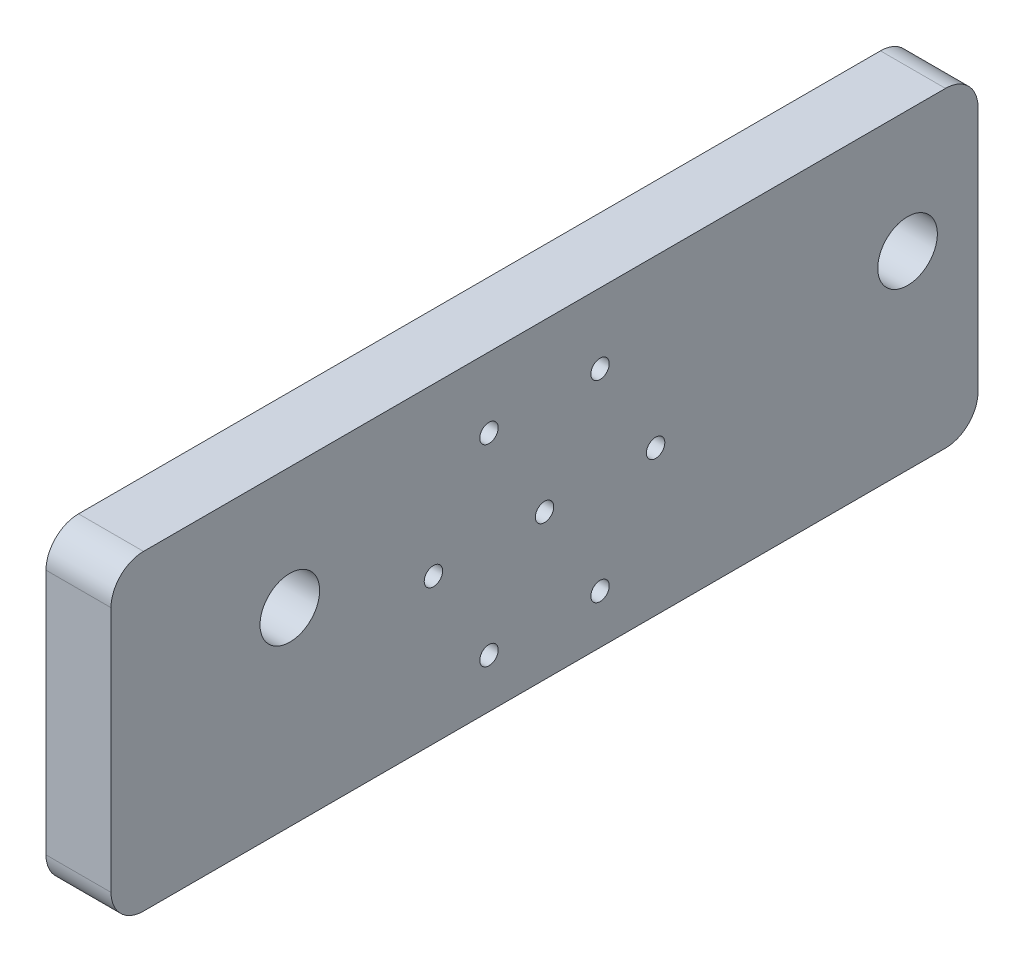
ISO-10303-21;
HEADER;
FILE_DESCRIPTION(('STEP AP214'),'2;1');
FILE_NAME('part.step','',(''),(''),'','','');
FILE_SCHEMA(('AUTOMOTIVE_DESIGN { 1 0 10303 214 1 1 1 1 }'));
ENDSEC;
DATA;
#1=APPLICATION_CONTEXT('core data for automotive mechanical design processes');
#2=APPLICATION_PROTOCOL_DEFINITION('international standard','automotive_design',2000,#1);
#3=PRODUCT_CONTEXT('',#1,'mechanical');
#4=PRODUCT('Part','Part','',(#3));
#5=PRODUCT_RELATED_PRODUCT_CATEGORY('part','',(#4));
#6=PRODUCT_DEFINITION_FORMATION('','',#4);
#7=PRODUCT_DEFINITION_CONTEXT('part definition',#1,'design');
#8=PRODUCT_DEFINITION('design','',#6,#7);
#9=PRODUCT_DEFINITION_SHAPE('','',#8);
#10=(LENGTH_UNIT() NAMED_UNIT(*) SI_UNIT(.MILLI.,.METRE.));
#11=(NAMED_UNIT(*) PLANE_ANGLE_UNIT() SI_UNIT($,.RADIAN.));
#12=(NAMED_UNIT(*) SI_UNIT($,.STERADIAN.) SOLID_ANGLE_UNIT());
#13=UNCERTAINTY_MEASURE_WITH_UNIT(LENGTH_MEASURE(1.E-05),#10,'distance_accuracy_value','');
#14=(GEOMETRIC_REPRESENTATION_CONTEXT(3) GLOBAL_UNCERTAINTY_ASSIGNED_CONTEXT((#13)) GLOBAL_UNIT_ASSIGNED_CONTEXT((#10,
#11,#12)) REPRESENTATION_CONTEXT('',''));
#15=CARTESIAN_POINT('',(0.,0.,0.));
#16=DIRECTION('',(0.,0.,1.));
#17=DIRECTION('',(1.,0.,0.));
#18=AXIS2_PLACEMENT_3D('',#15,#16,#17);
#19=CARTESIAN_POINT('',(0.,0.,0.));
#20=DIRECTION('',(1.,0.,0.));
#21=DIRECTION('',(0.,0.,-1.));
#22=AXIS2_PLACEMENT_3D('',#19,#20,#21);
#23=PLANE('',#22);
#24=DIRECTION('',(0.,1.,0.));
#25=VECTOR('',#24,1.);
#26=CARTESIAN_POINT('',(0.,14.375,-40.));
#27=LINE('',#26,#25);
#28=CARTESIAN_POINT('',(0.,-11.375,-40.));
#29=VERTEX_POINT('',#28);
#30=CARTESIAN_POINT('',(0.,11.375,-40.));
#31=VERTEX_POINT('',#30);
#32=EDGE_CURVE('E256',#29,#31,#27,.T.);
#33=ORIENTED_EDGE('',*,*,#32,.F.);
#34=CARTESIAN_POINT('',(0.,-11.375,-37.));
#35=DIRECTION('',(1.,0.,0.));
#36=DIRECTION('',(0.,0.,-1.));
#37=AXIS2_PLACEMENT_3D('',#34,#35,#36);
#38=CIRCLE('',#37,3.);
#39=CARTESIAN_POINT('',(0.,-14.375,-37.));
#40=VERTEX_POINT('',#39);
#41=EDGE_CURVE('E221',#29,#40,#38,.F.);
#42=ORIENTED_EDGE('',*,*,#41,.T.);
#43=DIRECTION('',(0.,0.,-1.));
#44=VECTOR('',#43,1.);
#45=CARTESIAN_POINT('',(0.,-14.375,40.));
#46=LINE('',#45,#44);
#47=CARTESIAN_POINT('',(0.,-14.375,37.));
#48=VERTEX_POINT('',#47);
#49=EDGE_CURVE('E258',#48,#40,#46,.T.);
#50=ORIENTED_EDGE('',*,*,#49,.F.);
#51=CARTESIAN_POINT('',(0.,-11.375,37.));
#52=DIRECTION('',(1.,0.,0.));
#53=DIRECTION('',(0.,0.,-1.));
#54=AXIS2_PLACEMENT_3D('',#51,#52,#53);
#55=CIRCLE('',#54,3.);
#56=CARTESIAN_POINT('',(0.,-11.375,40.));
#57=VERTEX_POINT('',#56);
#58=EDGE_CURVE('E215',#48,#57,#55,.F.);
#59=ORIENTED_EDGE('',*,*,#58,.T.);
#60=DIRECTION('',(0.,-1.,0.));
#61=VECTOR('',#60,1.);
#62=CARTESIAN_POINT('',(0.,14.375,40.));
#63=LINE('',#62,#61);
#64=CARTESIAN_POINT('',(0.,11.375,40.));
#65=VERTEX_POINT('',#64);
#66=EDGE_CURVE('E255',#65,#57,#63,.T.);
#67=ORIENTED_EDGE('',*,*,#66,.F.);
#68=CARTESIAN_POINT('',(0.,11.375,37.));
#69=DIRECTION('',(1.,0.,0.));
#70=DIRECTION('',(0.,0.,-1.));
#71=AXIS2_PLACEMENT_3D('',#68,#69,#70);
#72=CIRCLE('',#71,3.);
#73=CARTESIAN_POINT('',(0.,14.375,37.));
#74=VERTEX_POINT('',#73);
#75=EDGE_CURVE('E217',#65,#74,#72,.F.);
#76=ORIENTED_EDGE('',*,*,#75,.T.);
#77=DIRECTION('',(0.,0.,1.));
#78=VECTOR('',#77,1.);
#79=CARTESIAN_POINT('',(0.,14.375,40.));
#80=LINE('',#79,#78);
#81=CARTESIAN_POINT('',(0.,14.375,-37.));
#82=VERTEX_POINT('',#81);
#83=EDGE_CURVE('E245',#82,#74,#80,.T.);
#84=ORIENTED_EDGE('',*,*,#83,.F.);
#85=CARTESIAN_POINT('',(0.,11.375,-37.));
#86=DIRECTION('',(1.,0.,0.));
#87=DIRECTION('',(0.,0.,-1.));
#88=AXIS2_PLACEMENT_3D('',#85,#86,#87);
#89=CIRCLE('',#88,3.);
#90=EDGE_CURVE('E219',#82,#31,#89,.F.);
#91=ORIENTED_EDGE('',*,*,#90,.T.);
#92=EDGE_LOOP('',(#33,#42,#50,#59,#67,#76,#84,#91));
#93=FACE_BOUND('',#92,.T.);
#94=CARTESIAN_POINT('',(0.,3.125,23.5));
#95=DIRECTION('',(-1.,0.,0.));
#96=DIRECTION('',(0.,0.,1.));
#97=AXIS2_PLACEMENT_3D('',#94,#95,#96);
#98=CIRCLE('',#97,2.74999999999999);
#99=CARTESIAN_POINT('',(0.,3.125,26.25));
#100=VERTEX_POINT('',#99);
#101=EDGE_CURVE('E427',#100,#100,#98,.T.);
#102=ORIENTED_EDGE('',*,*,#101,.F.);
#103=EDGE_LOOP('',(#102));
#104=FACE_BOUND('',#103,.T.);
#105=CARTESIAN_POINT('',(0.,3.125,-33.5));
#106=DIRECTION('',(-1.,0.,0.));
#107=DIRECTION('',(0.,0.,1.));
#108=AXIS2_PLACEMENT_3D('',#105,#106,#107);
#109=CIRCLE('',#108,2.74999999999999);
#110=CARTESIAN_POINT('',(0.,3.125,-30.75));
#111=VERTEX_POINT('',#110);
#112=EDGE_CURVE('E422',#111,#111,#109,.T.);
#113=ORIENTED_EDGE('',*,*,#112,.F.);
#114=EDGE_LOOP('',(#113));
#115=FACE_BOUND('',#114,.T.);
#116=DIRECTION('',(0.,-1.,0.));
#117=VECTOR('',#116,1.);
#118=CARTESIAN_POINT('',(0.,0.,14.75));
#119=LINE('',#118,#117);
#120=CARTESIAN_POINT('',(0.,8.90176038879049,14.75));
#121=VERTEX_POINT('',#120);
#122=CARTESIAN_POINT('',(0.,-10.8517603887905,14.75));
#123=VERTEX_POINT('',#122);
#124=EDGE_CURVE('E461',#121,#123,#119,.T.);
#125=ORIENTED_EDGE('',*,*,#124,.T.);
#126=CARTESIAN_POINT('',(0.,-10.8517603887905,12.75));
#127=DIRECTION('',(1.,0.,0.));
#128=DIRECTION('',(0.,0.,-1.));
#129=AXIS2_PLACEMENT_3D('',#126,#127,#128);
#130=CIRCLE('',#129,2.);
#131=CARTESIAN_POINT('',(0.,-12.8517603887905,12.75));
#132=VERTEX_POINT('',#131);
#133=EDGE_CURVE('E159',#123,#132,#130,.T.);
#134=ORIENTED_EDGE('',*,*,#133,.T.);
#135=DIRECTION('',(0.,0.,-1.));
#136=VECTOR('',#135,1.);
#137=CARTESIAN_POINT('',(0.,-12.8517603887905,0.));
#138=LINE('',#137,#136);
#139=CARTESIAN_POINT('',(0.,-12.8517603887905,-12.75));
#140=VERTEX_POINT('',#139);
#141=EDGE_CURVE('E154',#132,#140,#138,.T.);
#142=ORIENTED_EDGE('',*,*,#141,.T.);
#143=CARTESIAN_POINT('',(0.,-10.8517603887905,-12.75));
#144=DIRECTION('',(1.,0.,0.));
#145=DIRECTION('',(0.,0.,-1.));
#146=AXIS2_PLACEMENT_3D('',#143,#144,#145);
#147=CIRCLE('',#146,2.);
#148=CARTESIAN_POINT('',(0.,-10.8517603887905,-14.75));
#149=VERTEX_POINT('',#148);
#150=EDGE_CURVE('E149',#140,#149,#147,.T.);
#151=ORIENTED_EDGE('',*,*,#150,.T.);
#152=DIRECTION('',(0.,1.,0.));
#153=VECTOR('',#152,1.);
#154=CARTESIAN_POINT('',(0.,0.,-14.75));
#155=LINE('',#154,#153);
#156=CARTESIAN_POINT('',(0.,8.90176038879049,-14.75));
#157=VERTEX_POINT('',#156);
#158=EDGE_CURVE('E152',#149,#157,#155,.T.);
#159=ORIENTED_EDGE('',*,*,#158,.T.);
#160=CARTESIAN_POINT('',(0.,8.90176038879049,-12.75));
#161=DIRECTION('',(1.,0.,0.));
#162=DIRECTION('',(0.,0.,-1.));
#163=AXIS2_PLACEMENT_3D('',#160,#161,#162);
#164=CIRCLE('',#163,2.);
#165=CARTESIAN_POINT('',(0.,10.9017603887905,-12.75));
#166=VERTEX_POINT('',#165);
#167=EDGE_CURVE('E160',#157,#166,#164,.T.);
#168=ORIENTED_EDGE('',*,*,#167,.T.);
#169=DIRECTION('',(0.,0.,1.));
#170=VECTOR('',#169,1.);
#171=CARTESIAN_POINT('',(0.,10.9017603887905,0.));
#172=LINE('',#171,#170);
#173=CARTESIAN_POINT('',(0.,10.9017603887905,12.75));
#174=VERTEX_POINT('',#173);
#175=EDGE_CURVE('E170',#166,#174,#172,.T.);
#176=ORIENTED_EDGE('',*,*,#175,.T.);
#177=CARTESIAN_POINT('',(0.,8.90176038879049,12.75));
#178=DIRECTION('',(1.,0.,0.));
#179=DIRECTION('',(0.,0.,-1.));
#180=AXIS2_PLACEMENT_3D('',#177,#178,#179);
#181=CIRCLE('',#180,2.);
#182=EDGE_CURVE('E208',#174,#121,#181,.T.);
#183=ORIENTED_EDGE('',*,*,#182,.T.);
#184=EDGE_LOOP('',(#125,#134,#142,#151,#159,#168,#176,#183));
#185=FACE_BOUND('',#184,.T.);
#186=ADVANCED_FACE('F35',(#93,#104,#115,#185),#23,.F.);
#187=CARTESIAN_POINT('',(6.,14.375,-40.));
#188=DIRECTION('',(0.,0.,1.));
#189=DIRECTION('',(0.,-1.,0.));
#190=AXIS2_PLACEMENT_3D('',#187,#188,#189);
#191=PLANE('',#190);
#192=DIRECTION('',(0.,1.,0.));
#193=VECTOR('',#192,1.);
#194=CARTESIAN_POINT('',(6.,14.375,-40.));
#195=LINE('',#194,#193);
#196=CARTESIAN_POINT('',(6.,-11.375,-40.));
#197=VERTEX_POINT('',#196);
#198=CARTESIAN_POINT('',(6.,11.375,-40.));
#199=VERTEX_POINT('',#198);
#200=EDGE_CURVE('E263',#197,#199,#195,.T.);
#201=ORIENTED_EDGE('',*,*,#200,.F.);
#202=DIRECTION('',(-1.,0.,0.));
#203=VECTOR('',#202,1.);
#204=CARTESIAN_POINT('',(6.,-11.375,-40.));
#205=LINE('',#204,#203);
#206=EDGE_CURVE('E212',#197,#29,#205,.T.);
#207=ORIENTED_EDGE('',*,*,#206,.T.);
#208=ORIENTED_EDGE('',*,*,#32,.T.);
#209=DIRECTION('',(-1.,0.,0.));
#210=VECTOR('',#209,1.);
#211=CARTESIAN_POINT('',(6.,11.375,-40.));
#212=LINE('',#211,#210);
#213=EDGE_CURVE('E210',#31,#199,#212,.F.);
#214=ORIENTED_EDGE('',*,*,#213,.T.);
#215=EDGE_LOOP('',(#201,#207,#208,#214));
#216=FACE_BOUND('',#215,.T.);
#217=ADVANCED_FACE('F286',(#216),#191,.F.);
#218=CARTESIAN_POINT('',(6.,14.375,40.));
#219=DIRECTION('',(0.,-1.,0.));
#220=DIRECTION('',(0.,0.,-1.));
#221=AXIS2_PLACEMENT_3D('',#218,#219,#220);
#222=PLANE('',#221);
#223=DIRECTION('',(0.,0.,1.));
#224=VECTOR('',#223,1.);
#225=CARTESIAN_POINT('',(6.,14.375,40.));
#226=LINE('',#225,#224);
#227=CARTESIAN_POINT('',(6.,14.375,-37.));
#228=VERTEX_POINT('',#227);
#229=CARTESIAN_POINT('',(6.,14.375,37.));
#230=VERTEX_POINT('',#229);
#231=EDGE_CURVE('E247',#228,#230,#226,.T.);
#232=ORIENTED_EDGE('',*,*,#231,.F.);
#233=DIRECTION('',(-1.,0.,0.));
#234=VECTOR('',#233,1.);
#235=CARTESIAN_POINT('',(6.,14.375,-37.));
#236=LINE('',#235,#234);
#237=EDGE_CURVE('E237',#228,#82,#236,.T.);
#238=ORIENTED_EDGE('',*,*,#237,.T.);
#239=ORIENTED_EDGE('',*,*,#83,.T.);
#240=DIRECTION('',(-1.,0.,0.));
#241=VECTOR('',#240,1.);
#242=CARTESIAN_POINT('',(6.,14.375,37.));
#243=LINE('',#242,#241);
#244=EDGE_CURVE('E235',#74,#230,#243,.F.);
#245=ORIENTED_EDGE('',*,*,#244,.T.);
#246=EDGE_LOOP('',(#232,#238,#239,#245));
#247=FACE_BOUND('',#246,.T.);
#248=ADVANCED_FACE('F244',(#247),#222,.F.);
#249=CARTESIAN_POINT('',(6.,14.375,40.));
#250=DIRECTION('',(0.,0.,-1.));
#251=DIRECTION('',(0.,1.,0.));
#252=AXIS2_PLACEMENT_3D('',#249,#250,#251);
#253=PLANE('',#252);
#254=DIRECTION('',(0.,-1.,0.));
#255=VECTOR('',#254,1.);
#256=CARTESIAN_POINT('',(6.,14.375,40.));
#257=LINE('',#256,#255);
#258=CARTESIAN_POINT('',(6.,11.375,40.));
#259=VERTEX_POINT('',#258);
#260=CARTESIAN_POINT('',(6.,-11.375,40.));
#261=VERTEX_POINT('',#260);
#262=EDGE_CURVE('E180',#259,#261,#257,.T.);
#263=ORIENTED_EDGE('',*,*,#262,.F.);
#264=DIRECTION('',(-1.,0.,0.));
#265=VECTOR('',#264,1.);
#266=CARTESIAN_POINT('',(6.,11.375,40.));
#267=LINE('',#266,#265);
#268=EDGE_CURVE('E11',#259,#65,#267,.T.);
#269=ORIENTED_EDGE('',*,*,#268,.T.);
#270=ORIENTED_EDGE('',*,*,#66,.T.);
#271=DIRECTION('',(-1.,0.,0.));
#272=VECTOR('',#271,1.);
#273=CARTESIAN_POINT('',(6.,-11.375,40.));
#274=LINE('',#273,#272);
#275=EDGE_CURVE('E43',#57,#261,#274,.F.);
#276=ORIENTED_EDGE('',*,*,#275,.T.);
#277=EDGE_LOOP('',(#263,#269,#270,#276));
#278=FACE_BOUND('',#277,.T.);
#279=ADVANCED_FACE('F291',(#278),#253,.F.);
#280=CARTESIAN_POINT('',(6.,-14.375,40.));
#281=DIRECTION('',(0.,1.,0.));
#282=DIRECTION('',(0.,0.,1.));
#283=AXIS2_PLACEMENT_3D('',#280,#281,#282);
#284=PLANE('',#283);
#285=ORIENTED_EDGE('',*,*,#49,.T.);
#286=DIRECTION('',(-1.,0.,0.));
#287=VECTOR('',#286,1.);
#288=CARTESIAN_POINT('',(6.,-14.375,-37.));
#289=LINE('',#288,#287);
#290=CARTESIAN_POINT('',(6.,-14.375,-37.));
#291=VERTEX_POINT('',#290);
#292=EDGE_CURVE('E226',#40,#291,#289,.F.);
#293=ORIENTED_EDGE('',*,*,#292,.T.);
#294=DIRECTION('',(0.,0.,-1.));
#295=VECTOR('',#294,1.);
#296=CARTESIAN_POINT('',(6.,-14.375,40.));
#297=LINE('',#296,#295);
#298=CARTESIAN_POINT('',(6.,-14.375,37.));
#299=VERTEX_POINT('',#298);
#300=EDGE_CURVE('E175',#299,#291,#297,.T.);
#301=ORIENTED_EDGE('',*,*,#300,.F.);
#302=DIRECTION('',(-1.,0.,0.));
#303=VECTOR('',#302,1.);
#304=CARTESIAN_POINT('',(6.,-14.375,37.));
#305=LINE('',#304,#303);
#306=EDGE_CURVE('E223',#299,#48,#305,.T.);
#307=ORIENTED_EDGE('',*,*,#306,.T.);
#308=EDGE_LOOP('',(#285,#293,#301,#307));
#309=FACE_BOUND('',#308,.T.);
#310=ADVANCED_FACE('F280',(#309),#284,.F.);
#311=CARTESIAN_POINT('',(6.,0.,0.));
#312=DIRECTION('',(1.,0.,0.));
#313=DIRECTION('',(0.,0.,-1.));
#314=AXIS2_PLACEMENT_3D('',#311,#312,#313);
#315=PLANE('',#314);
#316=CARTESIAN_POINT('',(6.,-0.974999999999991,-10.25));
#317=DIRECTION('',(-1.,0.,0.));
#318=DIRECTION('',(0.,0.,1.));
#319=AXIS2_PLACEMENT_3D('',#316,#317,#318);
#320=CIRCLE('',#319,0.849999999999998);
#321=CARTESIAN_POINT('',(6.,-0.974999999999991,-9.4));
#322=VERTEX_POINT('',#321);
#323=EDGE_CURVE('E397',#322,#322,#320,.T.);
#324=ORIENTED_EDGE('',*,*,#323,.T.);
#325=EDGE_LOOP('',(#324));
#326=FACE_BOUND('',#325,.T.);
#327=CARTESIAN_POINT('',(6.,-0.974999999999995,10.25));
#328=DIRECTION('',(-1.,0.,0.));
#329=DIRECTION('',(0.,0.,1.));
#330=AXIS2_PLACEMENT_3D('',#327,#328,#329);
#331=CIRCLE('',#330,0.849999999999998);
#332=CARTESIAN_POINT('',(6.,-0.974999999999995,11.1));
#333=VERTEX_POINT('',#332);
#334=EDGE_CURVE('E400',#333,#333,#331,.T.);
#335=ORIENTED_EDGE('',*,*,#334,.T.);
#336=EDGE_LOOP('',(#335));
#337=FACE_BOUND('',#336,.T.);
#338=CARTESIAN_POINT('',(6.,-0.974999999999997,0.));
#339=DIRECTION('',(-1.,0.,0.));
#340=DIRECTION('',(0.,0.,1.));
#341=AXIS2_PLACEMENT_3D('',#338,#339,#340);
#342=CIRCLE('',#341,0.849999999999998);
#343=CARTESIAN_POINT('',(6.,-0.974999999999997,0.849999999999998));
#344=VERTEX_POINT('',#343);
#345=EDGE_CURVE('E407',#344,#344,#342,.T.);
#346=ORIENTED_EDGE('',*,*,#345,.T.);
#347=EDGE_LOOP('',(#346));
#348=FACE_BOUND('',#347,.T.);
#349=CARTESIAN_POINT('',(6.,-9.85176038879047,-5.12500000000005));
#350=DIRECTION('',(-1.,0.,0.));
#351=DIRECTION('',(0.,0.,1.));
#352=AXIS2_PLACEMENT_3D('',#349,#350,#351);
#353=CIRCLE('',#352,0.849999999999998);
#354=CARTESIAN_POINT('',(6.,-9.85176038879047,-4.27500000000005));
#355=VERTEX_POINT('',#354);
#356=EDGE_CURVE('E410',#355,#355,#353,.T.);
#357=ORIENTED_EDGE('',*,*,#356,.T.);
#358=EDGE_LOOP('',(#357));
#359=FACE_BOUND('',#358,.T.);
#360=CARTESIAN_POINT('',(6.,-9.85176038879047,5.12500000000004));
#361=DIRECTION('',(-1.,0.,0.));
#362=DIRECTION('',(0.,0.,1.));
#363=AXIS2_PLACEMENT_3D('',#360,#361,#362);
#364=CIRCLE('',#363,0.849999999999998);
#365=CARTESIAN_POINT('',(6.,-9.85176038879047,5.97500000000004));
#366=VERTEX_POINT('',#365);
#367=EDGE_CURVE('E413',#366,#366,#364,.T.);
#368=ORIENTED_EDGE('',*,*,#367,.T.);
#369=EDGE_LOOP('',(#368));
#370=FACE_BOUND('',#369,.T.);
#371=CARTESIAN_POINT('',(6.,7.90176038879048,5.12500000000005));
#372=DIRECTION('',(-1.,0.,0.));
#373=DIRECTION('',(0.,0.,1.));
#374=AXIS2_PLACEMENT_3D('',#371,#372,#373);
#375=CIRCLE('',#374,0.849999999999998);
#376=CARTESIAN_POINT('',(6.,7.90176038879048,5.97500000000004));
#377=VERTEX_POINT('',#376);
#378=EDGE_CURVE('E416',#377,#377,#375,.T.);
#379=ORIENTED_EDGE('',*,*,#378,.T.);
#380=EDGE_LOOP('',(#379));
#381=FACE_BOUND('',#380,.T.);
#382=CARTESIAN_POINT('',(6.,7.90176038879047,-5.12500000000004));
#383=DIRECTION('',(-1.,0.,0.));
#384=DIRECTION('',(0.,0.,1.));
#385=AXIS2_PLACEMENT_3D('',#382,#383,#384);
#386=CIRCLE('',#385,0.849999999999998);
#387=CARTESIAN_POINT('',(6.,7.90176038879047,-4.27500000000004));
#388=VERTEX_POINT('',#387);
#389=EDGE_CURVE('E419',#388,#388,#386,.T.);
#390=ORIENTED_EDGE('',*,*,#389,.T.);
#391=EDGE_LOOP('',(#390));
#392=FACE_BOUND('',#391,.T.);
#393=CARTESIAN_POINT('',(6.,3.125,-33.5));
#394=DIRECTION('',(-1.,0.,0.));
#395=DIRECTION('',(0.,0.,1.));
#396=AXIS2_PLACEMENT_3D('',#393,#394,#395);
#397=CIRCLE('',#396,2.75);
#398=CARTESIAN_POINT('',(6.,3.125,-30.75));
#399=VERTEX_POINT('',#398);
#400=EDGE_CURVE('E425',#399,#399,#397,.T.);
#401=ORIENTED_EDGE('',*,*,#400,.T.);
#402=EDGE_LOOP('',(#401));
#403=FACE_BOUND('',#402,.T.);
#404=CARTESIAN_POINT('',(6.,3.125,23.5));
#405=DIRECTION('',(-1.,0.,0.));
#406=DIRECTION('',(0.,0.,1.));
#407=AXIS2_PLACEMENT_3D('',#404,#405,#406);
#408=CIRCLE('',#407,2.75);
#409=CARTESIAN_POINT('',(6.,3.125,26.25));
#410=VERTEX_POINT('',#409);
#411=EDGE_CURVE('E260',#410,#410,#408,.T.);
#412=ORIENTED_EDGE('',*,*,#411,.T.);
#413=EDGE_LOOP('',(#412));
#414=FACE_BOUND('',#413,.T.);
#415=ORIENTED_EDGE('',*,*,#300,.T.);
#416=CARTESIAN_POINT('',(6.,-11.375,-37.));
#417=DIRECTION('',(1.,0.,0.));
#418=DIRECTION('',(0.,0.,-1.));
#419=AXIS2_PLACEMENT_3D('',#416,#417,#418);
#420=CIRCLE('',#419,3.);
#421=EDGE_CURVE('E233',#291,#197,#420,.T.);
#422=ORIENTED_EDGE('',*,*,#421,.T.);
#423=ORIENTED_EDGE('',*,*,#200,.T.);
#424=CARTESIAN_POINT('',(6.,11.375,-37.));
#425=DIRECTION('',(1.,0.,0.));
#426=DIRECTION('',(0.,0.,-1.));
#427=AXIS2_PLACEMENT_3D('',#424,#425,#426);
#428=CIRCLE('',#427,3.);
#429=EDGE_CURVE('E231',#199,#228,#428,.T.);
#430=ORIENTED_EDGE('',*,*,#429,.T.);
#431=ORIENTED_EDGE('',*,*,#231,.T.);
#432=CARTESIAN_POINT('',(6.,11.375,37.));
#433=DIRECTION('',(1.,0.,0.));
#434=DIRECTION('',(0.,0.,-1.));
#435=AXIS2_PLACEMENT_3D('',#432,#433,#434);
#436=CIRCLE('',#435,3.);
#437=EDGE_CURVE('E56',#230,#259,#436,.T.);
#438=ORIENTED_EDGE('',*,*,#437,.T.);
#439=ORIENTED_EDGE('',*,*,#262,.T.);
#440=CARTESIAN_POINT('',(6.,-11.375,37.));
#441=DIRECTION('',(1.,0.,0.));
#442=DIRECTION('',(0.,0.,-1.));
#443=AXIS2_PLACEMENT_3D('',#440,#441,#442);
#444=CIRCLE('',#443,3.);
#445=EDGE_CURVE('E228',#261,#299,#444,.T.);
#446=ORIENTED_EDGE('',*,*,#445,.T.);
#447=EDGE_LOOP('',(#415,#422,#423,#430,#431,#438,#439,#446));
#448=FACE_BOUND('',#447,.T.);
#449=ADVANCED_FACE('F275',(#326,#337,#348,#359,#370,#381,#392,#403,#414,#448),#315,.T.);
#450=CARTESIAN_POINT('',(0.,3.125,23.5));
#451=DIRECTION('',(-1.,0.,0.));
#452=DIRECTION('',(0.,0.,1.));
#453=AXIS2_PLACEMENT_3D('',#450,#451,#452);
#454=CYLINDRICAL_SURFACE('',#453,2.74999999999999);
#455=ORIENTED_EDGE('',*,*,#411,.F.);
#456=EDGE_LOOP('',(#455));
#457=FACE_BOUND('',#456,.T.);
#458=ORIENTED_EDGE('',*,*,#101,.T.);
#459=EDGE_LOOP('',(#458));
#460=FACE_BOUND('',#459,.T.);
#461=ADVANCED_FACE('F309',(#457,#460),#454,.F.);
#462=CARTESIAN_POINT('',(0.,3.125,-33.5));
#463=DIRECTION('',(-1.,0.,0.));
#464=DIRECTION('',(0.,0.,1.));
#465=AXIS2_PLACEMENT_3D('',#462,#463,#464);
#466=CYLINDRICAL_SURFACE('',#465,2.74999999999999);
#467=ORIENTED_EDGE('',*,*,#400,.F.);
#468=EDGE_LOOP('',(#467));
#469=FACE_BOUND('',#468,.T.);
#470=ORIENTED_EDGE('',*,*,#112,.T.);
#471=EDGE_LOOP('',(#470));
#472=FACE_BOUND('',#471,.T.);
#473=ADVANCED_FACE('F313',(#469,#472),#466,.F.);
#474=CARTESIAN_POINT('',(0.,7.90176038879047,-5.12500000000004));
#475=DIRECTION('',(-1.,0.,0.));
#476=DIRECTION('',(0.,0.,1.));
#477=AXIS2_PLACEMENT_3D('',#474,#475,#476);
#478=CYLINDRICAL_SURFACE('',#477,0.849999999999993);
#479=CARTESIAN_POINT('',(2.,7.90176038879047,-5.12500000000004));
#480=DIRECTION('',(1.,0.,0.));
#481=DIRECTION('',(0.,0.,-1.));
#482=AXIS2_PLACEMENT_3D('',#479,#480,#481);
#483=CIRCLE('',#482,0.849999999999993);
#484=CARTESIAN_POINT('',(2.,7.90176038879047,-5.97500000000003));
#485=VERTEX_POINT('',#484);
#486=EDGE_CURVE('E396',#485,#485,#483,.F.);
#487=ORIENTED_EDGE('',*,*,#486,.T.);
#488=EDGE_LOOP('',(#487));
#489=FACE_BOUND('',#488,.T.);
#490=ORIENTED_EDGE('',*,*,#389,.F.);
#491=EDGE_LOOP('',(#490));
#492=FACE_BOUND('',#491,.T.);
#493=ADVANCED_FACE('F317',(#489,#492),#478,.F.);
#494=CARTESIAN_POINT('',(0.,7.90176038879048,5.12500000000005));
#495=DIRECTION('',(-1.,0.,0.));
#496=DIRECTION('',(0.,0.,1.));
#497=AXIS2_PLACEMENT_3D('',#494,#495,#496);
#498=CYLINDRICAL_SURFACE('',#497,0.849999999999993);
#499=CARTESIAN_POINT('',(2.,7.90176038879048,5.12500000000005));
#500=DIRECTION('',(1.,0.,0.));
#501=DIRECTION('',(0.,0.,-1.));
#502=AXIS2_PLACEMENT_3D('',#499,#500,#501);
#503=CIRCLE('',#502,0.849999999999993);
#504=CARTESIAN_POINT('',(2.,7.90176038879048,4.27500000000005));
#505=VERTEX_POINT('',#504);
#506=EDGE_CURVE('E369',#505,#505,#503,.F.);
#507=ORIENTED_EDGE('',*,*,#506,.T.);
#508=EDGE_LOOP('',(#507));
#509=FACE_BOUND('',#508,.T.);
#510=ORIENTED_EDGE('',*,*,#378,.F.);
#511=EDGE_LOOP('',(#510));
#512=FACE_BOUND('',#511,.T.);
#513=ADVANCED_FACE('F321',(#509,#512),#498,.F.);
#514=CARTESIAN_POINT('',(0.,-9.85176038879047,5.12500000000004));
#515=DIRECTION('',(-1.,0.,0.));
#516=DIRECTION('',(0.,0.,1.));
#517=AXIS2_PLACEMENT_3D('',#514,#515,#516);
#518=CYLINDRICAL_SURFACE('',#517,0.849999999999993);
#519=CARTESIAN_POINT('',(2.,-9.85176038879047,5.12500000000004));
#520=DIRECTION('',(1.,0.,0.));
#521=DIRECTION('',(0.,0.,-1.));
#522=AXIS2_PLACEMENT_3D('',#519,#520,#521);
#523=CIRCLE('',#522,0.849999999999993);
#524=CARTESIAN_POINT('',(2.,-9.85176038879047,4.27500000000004));
#525=VERTEX_POINT('',#524);
#526=EDGE_CURVE('E393',#525,#525,#523,.F.);
#527=ORIENTED_EDGE('',*,*,#526,.T.);
#528=EDGE_LOOP('',(#527));
#529=FACE_BOUND('',#528,.T.);
#530=ORIENTED_EDGE('',*,*,#367,.F.);
#531=EDGE_LOOP('',(#530));
#532=FACE_BOUND('',#531,.T.);
#533=ADVANCED_FACE('F325',(#529,#532),#518,.F.);
#534=CARTESIAN_POINT('',(0.,-9.85176038879047,-5.12500000000005));
#535=DIRECTION('',(-1.,0.,0.));
#536=DIRECTION('',(0.,0.,1.));
#537=AXIS2_PLACEMENT_3D('',#534,#535,#536);
#538=CYLINDRICAL_SURFACE('',#537,0.849999999999993);
#539=CARTESIAN_POINT('',(2.,-9.85176038879047,-5.12500000000005));
#540=DIRECTION('',(1.,0.,0.));
#541=DIRECTION('',(0.,0.,-1.));
#542=AXIS2_PLACEMENT_3D('',#539,#540,#541);
#543=CIRCLE('',#542,0.849999999999993);
#544=CARTESIAN_POINT('',(2.,-9.85176038879047,-5.97500000000004));
#545=VERTEX_POINT('',#544);
#546=EDGE_CURVE('E373',#545,#545,#543,.F.);
#547=ORIENTED_EDGE('',*,*,#546,.T.);
#548=EDGE_LOOP('',(#547));
#549=FACE_BOUND('',#548,.T.);
#550=ORIENTED_EDGE('',*,*,#356,.F.);
#551=EDGE_LOOP('',(#550));
#552=FACE_BOUND('',#551,.T.);
#553=ADVANCED_FACE('F329',(#549,#552),#538,.F.);
#554=CARTESIAN_POINT('',(0.,-0.974999999999997,0.));
#555=DIRECTION('',(-1.,0.,0.));
#556=DIRECTION('',(0.,0.,1.));
#557=AXIS2_PLACEMENT_3D('',#554,#555,#556);
#558=CYLINDRICAL_SURFACE('',#557,0.849999999999993);
#559=CARTESIAN_POINT('',(2.,-0.974999999999997,0.));
#560=DIRECTION('',(1.,0.,0.));
#561=DIRECTION('',(0.,0.,-1.));
#562=AXIS2_PLACEMENT_3D('',#559,#560,#561);
#563=CIRCLE('',#562,0.849999999999993);
#564=CARTESIAN_POINT('',(2.,-0.974999999999997,-0.849999999999993));
#565=VERTEX_POINT('',#564);
#566=EDGE_CURVE('E389',#565,#565,#563,.F.);
#567=ORIENTED_EDGE('',*,*,#566,.T.);
#568=EDGE_LOOP('',(#567));
#569=FACE_BOUND('',#568,.T.);
#570=ORIENTED_EDGE('',*,*,#345,.F.);
#571=EDGE_LOOP('',(#570));
#572=FACE_BOUND('',#571,.T.);
#573=ADVANCED_FACE('F333',(#569,#572),#558,.F.);
#574=CARTESIAN_POINT('',(0.,-0.974999999999995,10.25));
#575=DIRECTION('',(-1.,0.,0.));
#576=DIRECTION('',(0.,0.,1.));
#577=AXIS2_PLACEMENT_3D('',#574,#575,#576);
#578=CYLINDRICAL_SURFACE('',#577,0.849999999999993);
#579=CARTESIAN_POINT('',(2.,-0.974999999999995,10.25));
#580=DIRECTION('',(1.,0.,0.));
#581=DIRECTION('',(0.,0.,-1.));
#582=AXIS2_PLACEMENT_3D('',#579,#580,#581);
#583=CIRCLE('',#582,0.849999999999993);
#584=CARTESIAN_POINT('',(2.,-0.974999999999995,9.40000000000001));
#585=VERTEX_POINT('',#584);
#586=EDGE_CURVE('E377',#585,#585,#583,.F.);
#587=ORIENTED_EDGE('',*,*,#586,.T.);
#588=EDGE_LOOP('',(#587));
#589=FACE_BOUND('',#588,.T.);
#590=ORIENTED_EDGE('',*,*,#334,.F.);
#591=EDGE_LOOP('',(#590));
#592=FACE_BOUND('',#591,.T.);
#593=ADVANCED_FACE('F337',(#589,#592),#578,.F.);
#594=CARTESIAN_POINT('',(0.,-0.974999999999991,-10.25));
#595=DIRECTION('',(-1.,0.,0.));
#596=DIRECTION('',(0.,0.,1.));
#597=AXIS2_PLACEMENT_3D('',#594,#595,#596);
#598=CYLINDRICAL_SURFACE('',#597,0.849999999999993);
#599=CARTESIAN_POINT('',(2.,-0.974999999999991,-10.25));
#600=DIRECTION('',(1.,0.,0.));
#601=DIRECTION('',(0.,0.,-1.));
#602=AXIS2_PLACEMENT_3D('',#599,#600,#601);
#603=CIRCLE('',#602,0.849999999999993);
#604=CARTESIAN_POINT('',(2.,-0.974999999999991,-11.1));
#605=VERTEX_POINT('',#604);
#606=EDGE_CURVE('E183',#605,#605,#603,.F.);
#607=ORIENTED_EDGE('',*,*,#606,.T.);
#608=EDGE_LOOP('',(#607));
#609=FACE_BOUND('',#608,.T.);
#610=ORIENTED_EDGE('',*,*,#323,.F.);
#611=EDGE_LOOP('',(#610));
#612=FACE_BOUND('',#611,.T.);
#613=ADVANCED_FACE('F341',(#609,#612),#598,.F.);
#614=CARTESIAN_POINT('',(2.,0.,0.));
#615=DIRECTION('',(1.,0.,0.));
#616=DIRECTION('',(0.,0.,-1.));
#617=AXIS2_PLACEMENT_3D('',#614,#615,#616);
#618=PLANE('',#617);
#619=ORIENTED_EDGE('',*,*,#506,.F.);
#620=EDGE_LOOP('',(#619));
#621=FACE_BOUND('',#620,.T.);
#622=ORIENTED_EDGE('',*,*,#546,.F.);
#623=EDGE_LOOP('',(#622));
#624=FACE_BOUND('',#623,.T.);
#625=ORIENTED_EDGE('',*,*,#586,.F.);
#626=EDGE_LOOP('',(#625));
#627=FACE_BOUND('',#626,.T.);
#628=DIRECTION('',(0.,0.,1.));
#629=VECTOR('',#628,1.);
#630=CARTESIAN_POINT('',(2.,10.9017603887905,0.));
#631=LINE('',#630,#629);
#632=CARTESIAN_POINT('',(2.,10.9017603887905,-12.75));
#633=VERTEX_POINT('',#632);
#634=CARTESIAN_POINT('',(2.,10.9017603887905,12.75));
#635=VERTEX_POINT('',#634);
#636=EDGE_CURVE('E381',#633,#635,#631,.T.);
#637=ORIENTED_EDGE('',*,*,#636,.F.);
#638=CARTESIAN_POINT('',(2.,8.90176038879049,-12.75));
#639=DIRECTION('',(1.,0.,0.));
#640=DIRECTION('',(0.,0.,-1.));
#641=AXIS2_PLACEMENT_3D('',#638,#639,#640);
#642=CIRCLE('',#641,2.);
#643=CARTESIAN_POINT('',(2.,8.90176038879049,-14.75));
#644=VERTEX_POINT('',#643);
#645=EDGE_CURVE('E195',#633,#644,#642,.F.);
#646=ORIENTED_EDGE('',*,*,#645,.T.);
#647=DIRECTION('',(0.,1.,0.));
#648=VECTOR('',#647,1.);
#649=CARTESIAN_POINT('',(2.,0.,-14.75));
#650=LINE('',#649,#648);
#651=CARTESIAN_POINT('',(2.,-10.8517603887905,-14.75));
#652=VERTEX_POINT('',#651);
#653=EDGE_CURVE('E471',#652,#644,#650,.T.);
#654=ORIENTED_EDGE('',*,*,#653,.F.);
#655=CARTESIAN_POINT('',(2.,-10.8517603887905,-12.75));
#656=DIRECTION('',(1.,0.,0.));
#657=DIRECTION('',(0.,0.,-1.));
#658=AXIS2_PLACEMENT_3D('',#655,#656,#657);
#659=CIRCLE('',#658,2.);
#660=CARTESIAN_POINT('',(2.,-12.8517603887905,-12.75));
#661=VERTEX_POINT('',#660);
#662=EDGE_CURVE('E174',#652,#661,#659,.F.);
#663=ORIENTED_EDGE('',*,*,#662,.T.);
#664=DIRECTION('',(0.,0.,-1.));
#665=VECTOR('',#664,1.);
#666=CARTESIAN_POINT('',(2.,-12.8517603887905,0.));
#667=LINE('',#666,#665);
#668=CARTESIAN_POINT('',(2.,-12.8517603887905,12.75));
#669=VERTEX_POINT('',#668);
#670=EDGE_CURVE('E463',#669,#661,#667,.T.);
#671=ORIENTED_EDGE('',*,*,#670,.F.);
#672=CARTESIAN_POINT('',(2.,-10.8517603887905,12.75));
#673=DIRECTION('',(1.,0.,0.));
#674=DIRECTION('',(0.,0.,-1.));
#675=AXIS2_PLACEMENT_3D('',#672,#673,#674);
#676=CIRCLE('',#675,2.);
#677=CARTESIAN_POINT('',(2.,-10.8517603887905,14.75));
#678=VERTEX_POINT('',#677);
#679=EDGE_CURVE('E192',#669,#678,#676,.F.);
#680=ORIENTED_EDGE('',*,*,#679,.T.);
#681=DIRECTION('',(0.,-1.,0.));
#682=VECTOR('',#681,1.);
#683=CARTESIAN_POINT('',(2.,0.,14.75));
#684=LINE('',#683,#682);
#685=CARTESIAN_POINT('',(2.,8.90176038879049,14.75));
#686=VERTEX_POINT('',#685);
#687=EDGE_CURVE('E467',#686,#678,#684,.T.);
#688=ORIENTED_EDGE('',*,*,#687,.F.);
#689=CARTESIAN_POINT('',(2.,8.90176038879049,12.75));
#690=DIRECTION('',(1.,0.,0.));
#691=DIRECTION('',(0.,0.,-1.));
#692=AXIS2_PLACEMENT_3D('',#689,#690,#691);
#693=CIRCLE('',#692,2.);
#694=EDGE_CURVE('E190',#686,#635,#693,.F.);
#695=ORIENTED_EDGE('',*,*,#694,.T.);
#696=EDGE_LOOP('',(#637,#646,#654,#663,#671,#680,#688,#695));
#697=FACE_BOUND('',#696,.T.);
#698=ORIENTED_EDGE('',*,*,#606,.F.);
#699=EDGE_LOOP('',(#698));
#700=FACE_BOUND('',#699,.T.);
#701=ORIENTED_EDGE('',*,*,#566,.F.);
#702=EDGE_LOOP('',(#701));
#703=FACE_BOUND('',#702,.T.);
#704=ORIENTED_EDGE('',*,*,#526,.F.);
#705=EDGE_LOOP('',(#704));
#706=FACE_BOUND('',#705,.T.);
#707=ORIENTED_EDGE('',*,*,#486,.F.);
#708=EDGE_LOOP('',(#707));
#709=FACE_BOUND('',#708,.T.);
#710=ADVANCED_FACE('F345',(#621,#624,#627,#697,#700,#703,#706,#709),#618,.F.);
#711=CARTESIAN_POINT('',(2.,-12.8517603887905,0.));
#712=DIRECTION('',(0.,1.,0.));
#713=DIRECTION('',(0.,0.,1.));
#714=AXIS2_PLACEMENT_3D('',#711,#712,#713);
#715=PLANE('',#714);
#716=ORIENTED_EDGE('',*,*,#670,.T.);
#717=DIRECTION('',(-1.,0.,0.));
#718=VECTOR('',#717,1.);
#719=CARTESIAN_POINT('',(0.,-12.8517603887905,-12.75));
#720=LINE('',#719,#718);
#721=EDGE_CURVE('E199',#661,#140,#720,.T.);
#722=ORIENTED_EDGE('',*,*,#721,.T.);
#723=ORIENTED_EDGE('',*,*,#141,.F.);
#724=DIRECTION('',(-1.,0.,0.));
#725=VECTOR('',#724,1.);
#726=CARTESIAN_POINT('',(2.,-12.8517603887905,12.75));
#727=LINE('',#726,#725);
#728=EDGE_CURVE('E197',#132,#669,#727,.F.);
#729=ORIENTED_EDGE('',*,*,#728,.T.);
#730=EDGE_LOOP('',(#716,#722,#723,#729));
#731=FACE_BOUND('',#730,.T.);
#732=ADVANCED_FACE('F347',(#731),#715,.T.);
#733=CARTESIAN_POINT('',(2.,0.,-14.75));
#734=DIRECTION('',(0.,0.,1.));
#735=DIRECTION('',(1.,0.,0.));
#736=AXIS2_PLACEMENT_3D('',#733,#734,#735);
#737=PLANE('',#736);
#738=ORIENTED_EDGE('',*,*,#653,.T.);
#739=DIRECTION('',(-1.,0.,0.));
#740=VECTOR('',#739,1.);
#741=CARTESIAN_POINT('',(0.,8.90176038879049,-14.75));
#742=LINE('',#741,#740);
#743=EDGE_CURVE('E169',#644,#157,#742,.T.);
#744=ORIENTED_EDGE('',*,*,#743,.T.);
#745=ORIENTED_EDGE('',*,*,#158,.F.);
#746=DIRECTION('',(-1.,0.,0.));
#747=VECTOR('',#746,1.);
#748=CARTESIAN_POINT('',(2.,-10.8517603887905,-14.75));
#749=LINE('',#748,#747);
#750=EDGE_CURVE('E166',#149,#652,#749,.F.);
#751=ORIENTED_EDGE('',*,*,#750,.T.);
#752=EDGE_LOOP('',(#738,#744,#745,#751));
#753=FACE_BOUND('',#752,.T.);
#754=ADVANCED_FACE('F165',(#753),#737,.T.);
#755=CARTESIAN_POINT('',(2.,10.9017603887905,0.));
#756=DIRECTION('',(0.,-1.,0.));
#757=DIRECTION('',(0.,0.,-1.));
#758=AXIS2_PLACEMENT_3D('',#755,#756,#757);
#759=PLANE('',#758);
#760=ORIENTED_EDGE('',*,*,#175,.F.);
#761=DIRECTION('',(-1.,0.,0.));
#762=VECTOR('',#761,1.);
#763=CARTESIAN_POINT('',(2.,10.9017603887905,-12.75));
#764=LINE('',#763,#762);
#765=EDGE_CURVE('E188',#166,#633,#764,.F.);
#766=ORIENTED_EDGE('',*,*,#765,.T.);
#767=ORIENTED_EDGE('',*,*,#636,.T.);
#768=DIRECTION('',(-1.,0.,0.));
#769=VECTOR('',#768,1.);
#770=CARTESIAN_POINT('',(0.,10.9017603887905,12.75));
#771=LINE('',#770,#769);
#772=EDGE_CURVE('E177',#635,#174,#771,.T.);
#773=ORIENTED_EDGE('',*,*,#772,.T.);
#774=EDGE_LOOP('',(#760,#766,#767,#773));
#775=FACE_BOUND('',#774,.T.);
#776=ADVANCED_FACE('F353',(#775),#759,.T.);
#777=CARTESIAN_POINT('',(2.,0.,14.75));
#778=DIRECTION('',(0.,0.,-1.));
#779=DIRECTION('',(-1.,0.,0.));
#780=AXIS2_PLACEMENT_3D('',#777,#778,#779);
#781=PLANE('',#780);
#782=ORIENTED_EDGE('',*,*,#687,.T.);
#783=DIRECTION('',(-1.,0.,0.));
#784=VECTOR('',#783,1.);
#785=CARTESIAN_POINT('',(0.,-10.8517603887905,14.75));
#786=LINE('',#785,#784);
#787=EDGE_CURVE('E203',#678,#123,#786,.T.);
#788=ORIENTED_EDGE('',*,*,#787,.T.);
#789=ORIENTED_EDGE('',*,*,#124,.F.);
#790=DIRECTION('',(-1.,0.,0.));
#791=VECTOR('',#790,1.);
#792=CARTESIAN_POINT('',(2.,8.90176038879049,14.75));
#793=LINE('',#792,#791);
#794=EDGE_CURVE('E201',#121,#686,#793,.F.);
#795=ORIENTED_EDGE('',*,*,#794,.T.);
#796=EDGE_LOOP('',(#782,#788,#789,#795));
#797=FACE_BOUND('',#796,.T.);
#798=ADVANCED_FACE('F356',(#797),#781,.T.);
#799=CARTESIAN_POINT('',(2.,8.90176038879049,-12.75));
#800=DIRECTION('',(1.,0.,0.));
#801=DIRECTION('',(0.,0.,-1.));
#802=AXIS2_PLACEMENT_3D('',#799,#800,#801);
#803=CYLINDRICAL_SURFACE('',#802,2.);
#804=ORIENTED_EDGE('',*,*,#645,.F.);
#805=ORIENTED_EDGE('',*,*,#765,.F.);
#806=ORIENTED_EDGE('',*,*,#167,.F.);
#807=ORIENTED_EDGE('',*,*,#743,.F.);
#808=EDGE_LOOP('',(#804,#805,#806,#807));
#809=FACE_BOUND('',#808,.T.);
#810=ADVANCED_FACE('F360',(#809),#803,.F.);
#811=CARTESIAN_POINT('',(2.,-10.8517603887905,-12.75));
#812=DIRECTION('',(1.,0.,0.));
#813=DIRECTION('',(0.,0.,-1.));
#814=AXIS2_PLACEMENT_3D('',#811,#812,#813);
#815=CYLINDRICAL_SURFACE('',#814,2.);
#816=ORIENTED_EDGE('',*,*,#662,.F.);
#817=ORIENTED_EDGE('',*,*,#750,.F.);
#818=ORIENTED_EDGE('',*,*,#150,.F.);
#819=ORIENTED_EDGE('',*,*,#721,.F.);
#820=EDGE_LOOP('',(#816,#817,#818,#819));
#821=FACE_BOUND('',#820,.T.);
#822=ADVANCED_FACE('F173',(#821),#815,.F.);
#823=CARTESIAN_POINT('',(2.,-10.8517603887905,12.75));
#824=DIRECTION('',(1.,0.,0.));
#825=DIRECTION('',(0.,0.,-1.));
#826=AXIS2_PLACEMENT_3D('',#823,#824,#825);
#827=CYLINDRICAL_SURFACE('',#826,2.);
#828=ORIENTED_EDGE('',*,*,#679,.F.);
#829=ORIENTED_EDGE('',*,*,#728,.F.);
#830=ORIENTED_EDGE('',*,*,#133,.F.);
#831=ORIENTED_EDGE('',*,*,#787,.F.);
#832=EDGE_LOOP('',(#828,#829,#830,#831));
#833=FACE_BOUND('',#832,.T.);
#834=ADVANCED_FACE('F480',(#833),#827,.F.);
#835=CARTESIAN_POINT('',(2.,8.90176038879049,12.75));
#836=DIRECTION('',(1.,0.,0.));
#837=DIRECTION('',(0.,0.,-1.));
#838=AXIS2_PLACEMENT_3D('',#835,#836,#837);
#839=CYLINDRICAL_SURFACE('',#838,2.);
#840=ORIENTED_EDGE('',*,*,#694,.F.);
#841=ORIENTED_EDGE('',*,*,#794,.F.);
#842=ORIENTED_EDGE('',*,*,#182,.F.);
#843=ORIENTED_EDGE('',*,*,#772,.F.);
#844=EDGE_LOOP('',(#840,#841,#842,#843));
#845=FACE_BOUND('',#844,.T.);
#846=ADVANCED_FACE('F487',(#845),#839,.F.);
#847=CARTESIAN_POINT('',(6.,-11.375,-37.));
#848=DIRECTION('',(-1.,0.,0.));
#849=DIRECTION('',(0.,0.,1.));
#850=AXIS2_PLACEMENT_3D('',#847,#848,#849);
#851=CYLINDRICAL_SURFACE('',#850,3.);
#852=ORIENTED_EDGE('',*,*,#421,.F.);
#853=ORIENTED_EDGE('',*,*,#292,.F.);
#854=ORIENTED_EDGE('',*,*,#41,.F.);
#855=ORIENTED_EDGE('',*,*,#206,.F.);
#856=EDGE_LOOP('',(#852,#853,#854,#855));
#857=FACE_BOUND('',#856,.T.);
#858=ADVANCED_FACE('F284',(#857),#851,.T.);
#859=CARTESIAN_POINT('',(6.,11.375,-37.));
#860=DIRECTION('',(-1.,0.,0.));
#861=DIRECTION('',(0.,0.,1.));
#862=AXIS2_PLACEMENT_3D('',#859,#860,#861);
#863=CYLINDRICAL_SURFACE('',#862,3.);
#864=ORIENTED_EDGE('',*,*,#429,.F.);
#865=ORIENTED_EDGE('',*,*,#213,.F.);
#866=ORIENTED_EDGE('',*,*,#90,.F.);
#867=ORIENTED_EDGE('',*,*,#237,.F.);
#868=EDGE_LOOP('',(#864,#865,#866,#867));
#869=FACE_BOUND('',#868,.T.);
#870=ADVANCED_FACE('F288',(#869),#863,.T.);
#871=CARTESIAN_POINT('',(6.,11.375,37.));
#872=DIRECTION('',(-1.,0.,0.));
#873=DIRECTION('',(0.,0.,1.));
#874=AXIS2_PLACEMENT_3D('',#871,#872,#873);
#875=CYLINDRICAL_SURFACE('',#874,3.);
#876=ORIENTED_EDGE('',*,*,#437,.F.);
#877=ORIENTED_EDGE('',*,*,#244,.F.);
#878=ORIENTED_EDGE('',*,*,#75,.F.);
#879=ORIENTED_EDGE('',*,*,#268,.F.);
#880=EDGE_LOOP('',(#876,#877,#878,#879));
#881=FACE_BOUND('',#880,.T.);
#882=ADVANCED_FACE('F290',(#881),#875,.T.);
#883=CARTESIAN_POINT('',(6.,-11.375,37.));
#884=DIRECTION('',(-1.,0.,0.));
#885=DIRECTION('',(0.,0.,1.));
#886=AXIS2_PLACEMENT_3D('',#883,#884,#885);
#887=CYLINDRICAL_SURFACE('',#886,3.);
#888=ORIENTED_EDGE('',*,*,#445,.F.);
#889=ORIENTED_EDGE('',*,*,#275,.F.);
#890=ORIENTED_EDGE('',*,*,#58,.F.);
#891=ORIENTED_EDGE('',*,*,#306,.F.);
#892=EDGE_LOOP('',(#888,#889,#890,#891));
#893=FACE_BOUND('',#892,.T.);
#894=ADVANCED_FACE('F37',(#893),#887,.T.);
#895=CLOSED_SHELL('',(#186,#217,#248,#279,#310,#449,#461,#473,#493,#513,#533,#553,#573,#593,
#613,#710,#732,#754,#776,#798,#810,#822,#834,#846,#858,#870,#882,#894));
#896=MANIFOLD_SOLID_BREP('B2',#895);
#897=ADVANCED_BREP_SHAPE_REPRESENTATION('',(#18,#896),#14);
#898=SHAPE_DEFINITION_REPRESENTATION(#9,#897);
ENDSEC;
END-ISO-10303-21;
